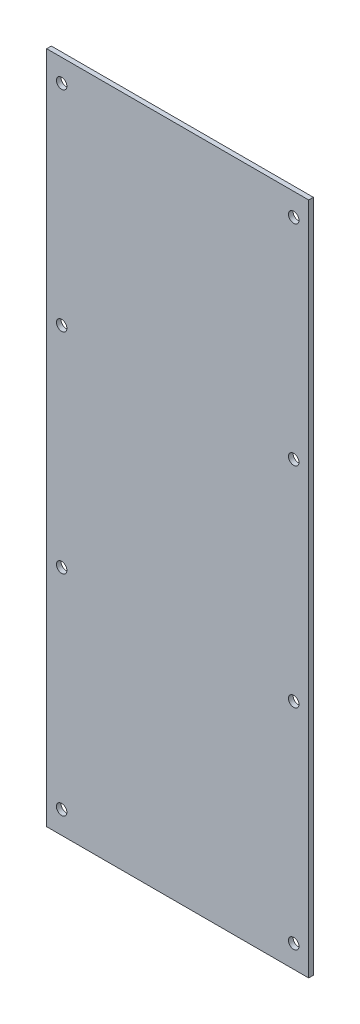
ISO-10303-21;
HEADER;
FILE_DESCRIPTION(('STEP AP214'),'2;1');
FILE_NAME('part.step','',(''),(''),'','','');
FILE_SCHEMA(('AUTOMOTIVE_DESIGN { 1 0 10303 214 1 1 1 1 }'));
ENDSEC;
DATA;
#1=APPLICATION_CONTEXT('core data for automotive mechanical design processes');
#2=APPLICATION_PROTOCOL_DEFINITION('international standard','automotive_design',2000,#1);
#3=PRODUCT_CONTEXT('',#1,'mechanical');
#4=PRODUCT('Part','Part','',(#3));
#5=PRODUCT_RELATED_PRODUCT_CATEGORY('part','',(#4));
#6=PRODUCT_DEFINITION_FORMATION('','',#4);
#7=PRODUCT_DEFINITION_CONTEXT('part definition',#1,'design');
#8=PRODUCT_DEFINITION('design','',#6,#7);
#9=PRODUCT_DEFINITION_SHAPE('','',#8);
#10=(LENGTH_UNIT() NAMED_UNIT(*) SI_UNIT(.MILLI.,.METRE.));
#11=(NAMED_UNIT(*) PLANE_ANGLE_UNIT() SI_UNIT($,.RADIAN.));
#12=(NAMED_UNIT(*) SI_UNIT($,.STERADIAN.) SOLID_ANGLE_UNIT());
#13=UNCERTAINTY_MEASURE_WITH_UNIT(LENGTH_MEASURE(1.E-05),#10,'distance_accuracy_value','');
#14=(GEOMETRIC_REPRESENTATION_CONTEXT(3) GLOBAL_UNCERTAINTY_ASSIGNED_CONTEXT((#13)) GLOBAL_UNIT_ASSIGNED_CONTEXT((#10,
#11,#12)) REPRESENTATION_CONTEXT('',''));
#15=CARTESIAN_POINT('',(0.,0.,0.));
#16=DIRECTION('',(0.,0.,1.));
#17=DIRECTION('',(1.,0.,0.));
#18=AXIS2_PLACEMENT_3D('',#15,#16,#17);
#19=CARTESIAN_POINT('',(0.,0.,1.5748));
#20=DIRECTION('',(1.,0.,0.));
#21=DIRECTION('',(0.,1.,0.));
#22=AXIS2_PLACEMENT_3D('',#19,#20,#21);
#23=PLANE('',#22);
#24=DIRECTION('',(0.,-1.,0.));
#25=VECTOR('',#24,1.);
#26=CARTESIAN_POINT('',(0.,0.,0.));
#27=LINE('',#26,#25);
#28=CARTESIAN_POINT('',(0.,0.,0.));
#29=VERTEX_POINT('',#28);
#30=CARTESIAN_POINT('',(0.,-228.6,0.));
#31=VERTEX_POINT('',#30);
#32=EDGE_CURVE('E71',#29,#31,#27,.T.);
#33=ORIENTED_EDGE('',*,*,#32,.T.);
#34=DIRECTION('',(0.,0.,-1.));
#35=VECTOR('',#34,1.);
#36=CARTESIAN_POINT('',(0.,-228.6,1.5748));
#37=LINE('',#36,#35);
#38=CARTESIAN_POINT('',(0.,-228.6,1.5748));
#39=VERTEX_POINT('',#38);
#40=EDGE_CURVE('E78',#39,#31,#37,.T.);
#41=ORIENTED_EDGE('',*,*,#40,.F.);
#42=DIRECTION('',(0.,-1.,0.));
#43=VECTOR('',#42,1.);
#44=CARTESIAN_POINT('',(0.,0.,1.5748));
#45=LINE('',#44,#43);
#46=CARTESIAN_POINT('',(0.,0.,1.5748));
#47=VERTEX_POINT('',#46);
#48=EDGE_CURVE('E99',#47,#39,#45,.T.);
#49=ORIENTED_EDGE('',*,*,#48,.F.);
#50=DIRECTION('',(0.,0.,-1.));
#51=VECTOR('',#50,1.);
#52=CARTESIAN_POINT('',(0.,0.,1.5748));
#53=LINE('',#52,#51);
#54=EDGE_CURVE('E87',#47,#29,#53,.T.);
#55=ORIENTED_EDGE('',*,*,#54,.T.);
#56=EDGE_LOOP('',(#33,#41,#49,#55));
#57=FACE_BOUND('',#56,.T.);
#58=ADVANCED_FACE('F24',(#57),#23,.F.);
#59=CARTESIAN_POINT('',(0.,-228.6,1.5748));
#60=DIRECTION('',(0.,1.,0.));
#61=DIRECTION('',(0.,0.,1.));
#62=AXIS2_PLACEMENT_3D('',#59,#60,#61);
#63=PLANE('',#62);
#64=DIRECTION('',(1.,0.,0.));
#65=VECTOR('',#64,1.);
#66=CARTESIAN_POINT('',(0.,-228.6,0.));
#67=LINE('',#66,#65);
#68=CARTESIAN_POINT('',(88.9,-228.6,0.));
#69=VERTEX_POINT('',#68);
#70=EDGE_CURVE('E65',#31,#69,#67,.T.);
#71=ORIENTED_EDGE('',*,*,#70,.T.);
#72=DIRECTION('',(0.,0.,-1.));
#73=VECTOR('',#72,1.);
#74=CARTESIAN_POINT('',(88.9,-228.6,1.5748));
#75=LINE('',#74,#73);
#76=CARTESIAN_POINT('',(88.9,-228.6,1.5748));
#77=VERTEX_POINT('',#76);
#78=EDGE_CURVE('E84',#77,#69,#75,.T.);
#79=ORIENTED_EDGE('',*,*,#78,.F.);
#80=DIRECTION('',(1.,0.,0.));
#81=VECTOR('',#80,1.);
#82=CARTESIAN_POINT('',(0.,-228.6,1.5748));
#83=LINE('',#82,#81);
#84=EDGE_CURVE('E80',#39,#77,#83,.T.);
#85=ORIENTED_EDGE('',*,*,#84,.F.);
#86=ORIENTED_EDGE('',*,*,#40,.T.);
#87=EDGE_LOOP('',(#71,#79,#85,#86));
#88=FACE_BOUND('',#87,.T.);
#89=ADVANCED_FACE('F79',(#88),#63,.F.);
#90=CARTESIAN_POINT('',(88.9,0.,1.5748));
#91=DIRECTION('',(-1.,0.,0.));
#92=DIRECTION('',(0.,-1.,0.));
#93=AXIS2_PLACEMENT_3D('',#90,#91,#92);
#94=PLANE('',#93);
#95=DIRECTION('',(0.,1.,0.));
#96=VECTOR('',#95,1.);
#97=CARTESIAN_POINT('',(88.9,0.,0.));
#98=LINE('',#97,#96);
#99=CARTESIAN_POINT('',(88.9,0.,0.));
#100=VERTEX_POINT('',#99);
#101=EDGE_CURVE('E72',#69,#100,#98,.T.);
#102=ORIENTED_EDGE('',*,*,#101,.T.);
#103=DIRECTION('',(0.,0.,-1.));
#104=VECTOR('',#103,1.);
#105=CARTESIAN_POINT('',(88.9,0.,1.5748));
#106=LINE('',#105,#104);
#107=CARTESIAN_POINT('',(88.9,0.,1.5748));
#108=VERTEX_POINT('',#107);
#109=EDGE_CURVE('E105',#108,#100,#106,.T.);
#110=ORIENTED_EDGE('',*,*,#109,.F.);
#111=DIRECTION('',(0.,1.,0.));
#112=VECTOR('',#111,1.);
#113=CARTESIAN_POINT('',(88.9,0.,1.5748));
#114=LINE('',#113,#112);
#115=EDGE_CURVE('E44',#77,#108,#114,.T.);
#116=ORIENTED_EDGE('',*,*,#115,.F.);
#117=ORIENTED_EDGE('',*,*,#78,.T.);
#118=EDGE_LOOP('',(#102,#110,#116,#117));
#119=FACE_BOUND('',#118,.T.);
#120=ADVANCED_FACE('F155',(#119),#94,.F.);
#121=CARTESIAN_POINT('',(0.,0.,1.5748));
#122=DIRECTION('',(0.,-1.,0.));
#123=DIRECTION('',(0.,0.,-1.));
#124=AXIS2_PLACEMENT_3D('',#121,#122,#123);
#125=PLANE('',#124);
#126=DIRECTION('',(-1.,0.,0.));
#127=VECTOR('',#126,1.);
#128=CARTESIAN_POINT('',(0.,0.,0.));
#129=LINE('',#128,#127);
#130=EDGE_CURVE('E97',#100,#29,#129,.T.);
#131=ORIENTED_EDGE('',*,*,#130,.T.);
#132=ORIENTED_EDGE('',*,*,#54,.F.);
#133=DIRECTION('',(-1.,0.,0.));
#134=VECTOR('',#133,1.);
#135=CARTESIAN_POINT('',(0.,0.,1.5748));
#136=LINE('',#135,#134);
#137=EDGE_CURVE('E39',#108,#47,#136,.T.);
#138=ORIENTED_EDGE('',*,*,#137,.F.);
#139=ORIENTED_EDGE('',*,*,#109,.T.);
#140=EDGE_LOOP('',(#131,#132,#138,#139));
#141=FACE_BOUND('',#140,.T.);
#142=ADVANCED_FACE('F144',(#141),#125,.F.);
#143=CARTESIAN_POINT('',(0.,-228.6,1.5748));
#144=DIRECTION('',(0.,0.,1.));
#145=DIRECTION('',(1.,0.,0.));
#146=AXIS2_PLACEMENT_3D('',#143,#144,#145);
#147=PLANE('',#146);
#148=CARTESIAN_POINT('',(83.82,-7.62,1.5748));
#149=DIRECTION('',(0.,0.,1.));
#150=DIRECTION('',(1.,0.,0.));
#151=AXIS2_PLACEMENT_3D('',#148,#149,#150);
#152=CIRCLE('',#151,1.778);
#153=CARTESIAN_POINT('',(85.598,-7.62,1.5748));
#154=VERTEX_POINT('',#153);
#155=EDGE_CURVE('E280',#154,#154,#152,.T.);
#156=ORIENTED_EDGE('',*,*,#155,.F.);
#157=EDGE_LOOP('',(#156));
#158=FACE_BOUND('',#157,.T.);
#159=CARTESIAN_POINT('',(5.08,-7.62,1.5748));
#160=DIRECTION('',(0.,0.,1.));
#161=DIRECTION('',(1.,0.,0.));
#162=AXIS2_PLACEMENT_3D('',#159,#160,#161);
#163=CIRCLE('',#162,1.778);
#164=CARTESIAN_POINT('',(6.858,-7.62,1.5748));
#165=VERTEX_POINT('',#164);
#166=EDGE_CURVE('E91',#165,#165,#163,.T.);
#167=ORIENTED_EDGE('',*,*,#166,.F.);
#168=EDGE_LOOP('',(#167));
#169=FACE_BOUND('',#168,.T.);
#170=ORIENTED_EDGE('',*,*,#48,.T.);
#171=ORIENTED_EDGE('',*,*,#84,.T.);
#172=ORIENTED_EDGE('',*,*,#115,.T.);
#173=ORIENTED_EDGE('',*,*,#137,.T.);
#174=EDGE_LOOP('',(#170,#171,#172,#173));
#175=FACE_BOUND('',#174,.T.);
#176=CARTESIAN_POINT('',(5.08000000000002,-78.74,1.5748));
#177=DIRECTION('',(0.,0.,1.));
#178=DIRECTION('',(1.,0.,0.));
#179=AXIS2_PLACEMENT_3D('',#176,#177,#178);
#180=CIRCLE('',#179,1.778);
#181=CARTESIAN_POINT('',(6.85800000000001,-78.74,1.5748));
#182=VERTEX_POINT('',#181);
#183=EDGE_CURVE('E83',#182,#182,#180,.T.);
#184=ORIENTED_EDGE('',*,*,#183,.F.);
#185=EDGE_LOOP('',(#184));
#186=FACE_BOUND('',#185,.T.);
#187=CARTESIAN_POINT('',(83.82,-78.74,1.5748));
#188=DIRECTION('',(0.,0.,1.));
#189=DIRECTION('',(1.,0.,0.));
#190=AXIS2_PLACEMENT_3D('',#187,#188,#189);
#191=CIRCLE('',#190,1.778);
#192=CARTESIAN_POINT('',(85.598,-78.74,1.5748));
#193=VERTEX_POINT('',#192);
#194=EDGE_CURVE('E114',#193,#193,#191,.T.);
#195=ORIENTED_EDGE('',*,*,#194,.F.);
#196=EDGE_LOOP('',(#195));
#197=FACE_BOUND('',#196,.T.);
#198=CARTESIAN_POINT('',(5.08000000000002,-149.86,1.5748));
#199=DIRECTION('',(0.,0.,1.));
#200=DIRECTION('',(1.,0.,0.));
#201=AXIS2_PLACEMENT_3D('',#198,#199,#200);
#202=CIRCLE('',#201,1.778);
#203=CARTESIAN_POINT('',(6.85800000000001,-149.86,1.5748));
#204=VERTEX_POINT('',#203);
#205=EDGE_CURVE('E120',#204,#204,#202,.T.);
#206=ORIENTED_EDGE('',*,*,#205,.F.);
#207=EDGE_LOOP('',(#206));
#208=FACE_BOUND('',#207,.T.);
#209=CARTESIAN_POINT('',(83.82,-149.86,1.5748));
#210=DIRECTION('',(0.,0.,1.));
#211=DIRECTION('',(1.,0.,0.));
#212=AXIS2_PLACEMENT_3D('',#209,#210,#211);
#213=CIRCLE('',#212,1.778);
#214=CARTESIAN_POINT('',(85.598,-149.86,1.5748));
#215=VERTEX_POINT('',#214);
#216=EDGE_CURVE('E126',#215,#215,#213,.T.);
#217=ORIENTED_EDGE('',*,*,#216,.F.);
#218=EDGE_LOOP('',(#217));
#219=FACE_BOUND('',#218,.T.);
#220=CARTESIAN_POINT('',(5.08000000000003,-220.98,1.5748));
#221=DIRECTION('',(0.,0.,1.));
#222=DIRECTION('',(1.,0.,0.));
#223=AXIS2_PLACEMENT_3D('',#220,#221,#222);
#224=CIRCLE('',#223,1.778);
#225=CARTESIAN_POINT('',(6.85800000000003,-220.98,1.5748));
#226=VERTEX_POINT('',#225);
#227=EDGE_CURVE('E132',#226,#226,#224,.T.);
#228=ORIENTED_EDGE('',*,*,#227,.F.);
#229=EDGE_LOOP('',(#228));
#230=FACE_BOUND('',#229,.T.);
#231=CARTESIAN_POINT('',(83.82,-220.98,1.5748));
#232=DIRECTION('',(0.,0.,1.));
#233=DIRECTION('',(1.,0.,0.));
#234=AXIS2_PLACEMENT_3D('',#231,#232,#233);
#235=CIRCLE('',#234,1.778);
#236=CARTESIAN_POINT('',(85.598,-220.98,1.5748));
#237=VERTEX_POINT('',#236);
#238=EDGE_CURVE('E32',#237,#237,#235,.T.);
#239=ORIENTED_EDGE('',*,*,#238,.F.);
#240=EDGE_LOOP('',(#239));
#241=FACE_BOUND('',#240,.T.);
#242=ADVANCED_FACE('F142',(#158,#169,#175,#186,#197,#208,#219,#230,#241),#147,.T.);
#243=CARTESIAN_POINT('',(0.,-228.6,0.));
#244=DIRECTION('',(0.,0.,1.));
#245=DIRECTION('',(1.,0.,0.));
#246=AXIS2_PLACEMENT_3D('',#243,#244,#245);
#247=PLANE('',#246);
#248=CARTESIAN_POINT('',(83.82,-7.62,0.));
#249=DIRECTION('',(0.,0.,1.));
#250=DIRECTION('',(1.,0.,0.));
#251=AXIS2_PLACEMENT_3D('',#248,#249,#250);
#252=CIRCLE('',#251,1.778);
#253=CARTESIAN_POINT('',(85.598,-7.62,0.));
#254=VERTEX_POINT('',#253);
#255=EDGE_CURVE('E278',#254,#254,#252,.T.);
#256=ORIENTED_EDGE('',*,*,#255,.T.);
#257=EDGE_LOOP('',(#256));
#258=FACE_BOUND('',#257,.T.);
#259=CARTESIAN_POINT('',(5.08,-7.62,0.));
#260=DIRECTION('',(0.,0.,1.));
#261=DIRECTION('',(1.,0.,0.));
#262=AXIS2_PLACEMENT_3D('',#259,#260,#261);
#263=CIRCLE('',#262,1.778);
#264=CARTESIAN_POINT('',(6.858,-7.62,0.));
#265=VERTEX_POINT('',#264);
#266=EDGE_CURVE('E88',#265,#265,#263,.T.);
#267=ORIENTED_EDGE('',*,*,#266,.T.);
#268=EDGE_LOOP('',(#267));
#269=FACE_BOUND('',#268,.T.);
#270=ORIENTED_EDGE('',*,*,#32,.F.);
#271=ORIENTED_EDGE('',*,*,#130,.F.);
#272=ORIENTED_EDGE('',*,*,#101,.F.);
#273=ORIENTED_EDGE('',*,*,#70,.F.);
#274=EDGE_LOOP('',(#270,#271,#272,#273));
#275=FACE_BOUND('',#274,.T.);
#276=CARTESIAN_POINT('',(5.08000000000002,-78.74,0.));
#277=DIRECTION('',(0.,0.,1.));
#278=DIRECTION('',(1.,0.,0.));
#279=AXIS2_PLACEMENT_3D('',#276,#277,#278);
#280=CIRCLE('',#279,1.778);
#281=CARTESIAN_POINT('',(6.85800000000001,-78.74,0.));
#282=VERTEX_POINT('',#281);
#283=EDGE_CURVE('E111',#282,#282,#280,.T.);
#284=ORIENTED_EDGE('',*,*,#283,.T.);
#285=EDGE_LOOP('',(#284));
#286=FACE_BOUND('',#285,.T.);
#287=CARTESIAN_POINT('',(83.82,-78.74,0.));
#288=DIRECTION('',(0.,0.,1.));
#289=DIRECTION('',(1.,0.,0.));
#290=AXIS2_PLACEMENT_3D('',#287,#288,#289);
#291=CIRCLE('',#290,1.778);
#292=CARTESIAN_POINT('',(85.598,-78.74,0.));
#293=VERTEX_POINT('',#292);
#294=EDGE_CURVE('E117',#293,#293,#291,.T.);
#295=ORIENTED_EDGE('',*,*,#294,.T.);
#296=EDGE_LOOP('',(#295));
#297=FACE_BOUND('',#296,.T.);
#298=CARTESIAN_POINT('',(5.08000000000002,-149.86,0.));
#299=DIRECTION('',(0.,0.,1.));
#300=DIRECTION('',(1.,0.,0.));
#301=AXIS2_PLACEMENT_3D('',#298,#299,#300);
#302=CIRCLE('',#301,1.778);
#303=CARTESIAN_POINT('',(6.85800000000001,-149.86,0.));
#304=VERTEX_POINT('',#303);
#305=EDGE_CURVE('E123',#304,#304,#302,.T.);
#306=ORIENTED_EDGE('',*,*,#305,.T.);
#307=EDGE_LOOP('',(#306));
#308=FACE_BOUND('',#307,.T.);
#309=CARTESIAN_POINT('',(83.82,-149.86,0.));
#310=DIRECTION('',(0.,0.,1.));
#311=DIRECTION('',(1.,0.,0.));
#312=AXIS2_PLACEMENT_3D('',#309,#310,#311);
#313=CIRCLE('',#312,1.778);
#314=CARTESIAN_POINT('',(85.598,-149.86,0.));
#315=VERTEX_POINT('',#314);
#316=EDGE_CURVE('E129',#315,#315,#313,.T.);
#317=ORIENTED_EDGE('',*,*,#316,.T.);
#318=EDGE_LOOP('',(#317));
#319=FACE_BOUND('',#318,.T.);
#320=CARTESIAN_POINT('',(5.08000000000003,-220.98,0.));
#321=DIRECTION('',(0.,0.,1.));
#322=DIRECTION('',(1.,0.,0.));
#323=AXIS2_PLACEMENT_3D('',#320,#321,#322);
#324=CIRCLE('',#323,1.778);
#325=CARTESIAN_POINT('',(6.85800000000003,-220.98,0.));
#326=VERTEX_POINT('',#325);
#327=EDGE_CURVE('E135',#326,#326,#324,.T.);
#328=ORIENTED_EDGE('',*,*,#327,.T.);
#329=EDGE_LOOP('',(#328));
#330=FACE_BOUND('',#329,.T.);
#331=CARTESIAN_POINT('',(83.82,-220.98,0.));
#332=DIRECTION('',(0.,0.,1.));
#333=DIRECTION('',(1.,0.,0.));
#334=AXIS2_PLACEMENT_3D('',#331,#332,#333);
#335=CIRCLE('',#334,1.778);
#336=CARTESIAN_POINT('',(85.598,-220.98,0.));
#337=VERTEX_POINT('',#336);
#338=EDGE_CURVE('E11',#337,#337,#335,.T.);
#339=ORIENTED_EDGE('',*,*,#338,.T.);
#340=EDGE_LOOP('',(#339));
#341=FACE_BOUND('',#340,.T.);
#342=ADVANCED_FACE('F67',(#258,#269,#275,#286,#297,#308,#319,#330,#341),#247,.F.);
#343=CARTESIAN_POINT('',(5.08,-7.62,-0.9652));
#344=DIRECTION('',(0.,0.,1.));
#345=DIRECTION('',(1.,0.,0.));
#346=AXIS2_PLACEMENT_3D('',#343,#344,#345);
#347=CYLINDRICAL_SURFACE('',#346,1.778);
#348=ORIENTED_EDGE('',*,*,#166,.T.);
#349=EDGE_LOOP('',(#348));
#350=FACE_BOUND('',#349,.T.);
#351=ORIENTED_EDGE('',*,*,#266,.F.);
#352=EDGE_LOOP('',(#351));
#353=FACE_BOUND('',#352,.T.);
#354=ADVANCED_FACE('F151',(#350,#353),#347,.F.);
#355=CARTESIAN_POINT('',(83.82,-7.62,-0.9652));
#356=DIRECTION('',(0.,0.,1.));
#357=DIRECTION('',(1.,0.,0.));
#358=AXIS2_PLACEMENT_3D('',#355,#356,#357);
#359=CYLINDRICAL_SURFACE('',#358,1.778);
#360=ORIENTED_EDGE('',*,*,#155,.T.);
#361=EDGE_LOOP('',(#360));
#362=FACE_BOUND('',#361,.T.);
#363=ORIENTED_EDGE('',*,*,#255,.F.);
#364=EDGE_LOOP('',(#363));
#365=FACE_BOUND('',#364,.T.);
#366=ADVANCED_FACE('F172',(#362,#365),#359,.F.);
#367=CARTESIAN_POINT('',(5.08000000000002,-78.74,-0.9652));
#368=DIRECTION('',(0.,0.,1.));
#369=DIRECTION('',(1.,0.,0.));
#370=AXIS2_PLACEMENT_3D('',#367,#368,#369);
#371=CYLINDRICAL_SURFACE('',#370,1.778);
#372=ORIENTED_EDGE('',*,*,#183,.T.);
#373=EDGE_LOOP('',(#372));
#374=FACE_BOUND('',#373,.T.);
#375=ORIENTED_EDGE('',*,*,#283,.F.);
#376=EDGE_LOOP('',(#375));
#377=FACE_BOUND('',#376,.T.);
#378=ADVANCED_FACE('F168',(#374,#377),#371,.F.);
#379=CARTESIAN_POINT('',(83.82,-78.74,-0.9652));
#380=DIRECTION('',(0.,0.,1.));
#381=DIRECTION('',(1.,0.,0.));
#382=AXIS2_PLACEMENT_3D('',#379,#380,#381);
#383=CYLINDRICAL_SURFACE('',#382,1.778);
#384=ORIENTED_EDGE('',*,*,#194,.T.);
#385=EDGE_LOOP('',(#384));
#386=FACE_BOUND('',#385,.T.);
#387=ORIENTED_EDGE('',*,*,#294,.F.);
#388=EDGE_LOOP('',(#387));
#389=FACE_BOUND('',#388,.T.);
#390=ADVANCED_FACE('F171',(#386,#389),#383,.F.);
#391=CARTESIAN_POINT('',(5.08000000000002,-149.86,-0.9652));
#392=DIRECTION('',(0.,0.,1.));
#393=DIRECTION('',(1.,0.,0.));
#394=AXIS2_PLACEMENT_3D('',#391,#392,#393);
#395=CYLINDRICAL_SURFACE('',#394,1.778);
#396=ORIENTED_EDGE('',*,*,#205,.T.);
#397=EDGE_LOOP('',(#396));
#398=FACE_BOUND('',#397,.T.);
#399=ORIENTED_EDGE('',*,*,#305,.F.);
#400=EDGE_LOOP('',(#399));
#401=FACE_BOUND('',#400,.T.);
#402=ADVANCED_FACE('F176',(#398,#401),#395,.F.);
#403=CARTESIAN_POINT('',(83.82,-149.86,-0.9652));
#404=DIRECTION('',(0.,0.,1.));
#405=DIRECTION('',(1.,0.,0.));
#406=AXIS2_PLACEMENT_3D('',#403,#404,#405);
#407=CYLINDRICAL_SURFACE('',#406,1.778);
#408=ORIENTED_EDGE('',*,*,#216,.T.);
#409=EDGE_LOOP('',(#408));
#410=FACE_BOUND('',#409,.T.);
#411=ORIENTED_EDGE('',*,*,#316,.F.);
#412=EDGE_LOOP('',(#411));
#413=FACE_BOUND('',#412,.T.);
#414=ADVANCED_FACE('F180',(#410,#413),#407,.F.);
#415=CARTESIAN_POINT('',(5.08000000000003,-220.98,-0.9652));
#416=DIRECTION('',(0.,0.,1.));
#417=DIRECTION('',(1.,0.,0.));
#418=AXIS2_PLACEMENT_3D('',#415,#416,#417);
#419=CYLINDRICAL_SURFACE('',#418,1.778);
#420=ORIENTED_EDGE('',*,*,#227,.T.);
#421=EDGE_LOOP('',(#420));
#422=FACE_BOUND('',#421,.T.);
#423=ORIENTED_EDGE('',*,*,#327,.F.);
#424=EDGE_LOOP('',(#423));
#425=FACE_BOUND('',#424,.T.);
#426=ADVANCED_FACE('F183',(#422,#425),#419,.F.);
#427=CARTESIAN_POINT('',(83.82,-220.98,-0.9652));
#428=DIRECTION('',(0.,0.,1.));
#429=DIRECTION('',(1.,0.,0.));
#430=AXIS2_PLACEMENT_3D('',#427,#428,#429);
#431=CYLINDRICAL_SURFACE('',#430,1.778);
#432=ORIENTED_EDGE('',*,*,#238,.T.);
#433=EDGE_LOOP('',(#432));
#434=FACE_BOUND('',#433,.T.);
#435=ORIENTED_EDGE('',*,*,#338,.F.);
#436=EDGE_LOOP('',(#435));
#437=FACE_BOUND('',#436,.T.);
#438=ADVANCED_FACE('F26',(#434,#437),#431,.F.);
#439=CLOSED_SHELL('',(#58,#89,#120,#142,#242,#342,#354,#366,#378,#390,#402,#414,#426,#438));
#440=MANIFOLD_SOLID_BREP('B2',#439);
#441=ADVANCED_BREP_SHAPE_REPRESENTATION('',(#18,#440),#14);
#442=SHAPE_DEFINITION_REPRESENTATION(#9,#441);
ENDSEC;
END-ISO-10303-21;
